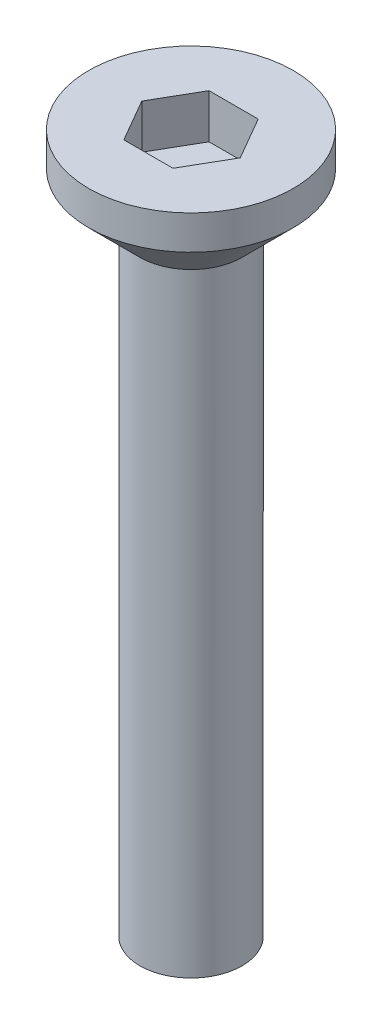
ISO-10303-21;
HEADER;
FILE_DESCRIPTION(('STEP AP214'),'2;1');
FILE_NAME('part.step','',(''),(''),'','','');
FILE_SCHEMA(('AUTOMOTIVE_DESIGN { 1 0 10303 214 1 1 1 1 }'));
ENDSEC;
DATA;
#1=APPLICATION_CONTEXT('core data for automotive mechanical design processes');
#2=APPLICATION_PROTOCOL_DEFINITION('international standard','automotive_design',2000,#1);
#3=PRODUCT_CONTEXT('',#1,'mechanical');
#4=PRODUCT('Part','Part','',(#3));
#5=PRODUCT_RELATED_PRODUCT_CATEGORY('part','',(#4));
#6=PRODUCT_DEFINITION_FORMATION('','',#4);
#7=PRODUCT_DEFINITION_CONTEXT('part definition',#1,'design');
#8=PRODUCT_DEFINITION('design','',#6,#7);
#9=PRODUCT_DEFINITION_SHAPE('','',#8);
#10=(LENGTH_UNIT() NAMED_UNIT(*) SI_UNIT(.MILLI.,.METRE.));
#11=(NAMED_UNIT(*) PLANE_ANGLE_UNIT() SI_UNIT($,.RADIAN.));
#12=(NAMED_UNIT(*) SI_UNIT($,.STERADIAN.) SOLID_ANGLE_UNIT());
#13=UNCERTAINTY_MEASURE_WITH_UNIT(LENGTH_MEASURE(1.E-05),#10,'distance_accuracy_value','');
#14=(GEOMETRIC_REPRESENTATION_CONTEXT(3) GLOBAL_UNCERTAINTY_ASSIGNED_CONTEXT((#13)) GLOBAL_UNIT_ASSIGNED_CONTEXT((#10,
#11,#12)) REPRESENTATION_CONTEXT('',''));
#15=CARTESIAN_POINT('',(0.,0.,0.));
#16=DIRECTION('',(0.,0.,1.));
#17=DIRECTION('',(1.,0.,0.));
#18=AXIS2_PLACEMENT_3D('',#15,#16,#17);
#19=CARTESIAN_POINT('',(0.,2.5,0.));
#20=DIRECTION('',(0.,-1.,0.));
#21=DIRECTION('',(0.,0.,-1.));
#22=AXIS2_PLACEMENT_3D('',#19,#20,#21);
#23=CYLINDRICAL_SURFACE('',#22,3.);
#24=CARTESIAN_POINT('',(0.,1.5,0.));
#25=DIRECTION('',(0.,1.,0.));
#26=DIRECTION('',(0.,0.,1.));
#27=AXIS2_PLACEMENT_3D('',#24,#25,#26);
#28=CIRCLE('',#27,3.);
#29=CARTESIAN_POINT('',(0.,1.5,3.));
#30=VERTEX_POINT('',#29);
#31=EDGE_CURVE('E45',#30,#30,#28,.T.);
#32=ORIENTED_EDGE('',*,*,#31,.T.);
#33=EDGE_LOOP('',(#32));
#34=FACE_BOUND('',#33,.T.);
#35=CARTESIAN_POINT('',(0.,2.5,0.));
#36=DIRECTION('',(0.,1.,0.));
#37=DIRECTION('',(0.,0.,1.));
#38=AXIS2_PLACEMENT_3D('',#35,#36,#37);
#39=CIRCLE('',#38,3.);
#40=CARTESIAN_POINT('',(0.,2.5,3.));
#41=VERTEX_POINT('',#40);
#42=EDGE_CURVE('E140',#41,#41,#39,.T.);
#43=ORIENTED_EDGE('',*,*,#42,.F.);
#44=EDGE_LOOP('',(#43));
#45=FACE_BOUND('',#44,.T.);
#46=ADVANCED_FACE('F37',(#34,#45),#23,.T.);
#47=CARTESIAN_POINT('',(0.,2.5,0.));
#48=DIRECTION('',(0.,1.,0.));
#49=DIRECTION('',(0.,0.,1.));
#50=AXIS2_PLACEMENT_3D('',#47,#48,#49);
#51=PLANE('',#50);
#52=DIRECTION('',(0.5,0.,-0.866025403784439));
#53=VECTOR('',#52,1.);
#54=CARTESIAN_POINT('',(0.721687836487032,2.5,1.25));
#55=LINE('',#54,#53);
#56=CARTESIAN_POINT('',(0.721687836487032,2.5,1.25));
#57=VERTEX_POINT('',#56);
#58=CARTESIAN_POINT('',(1.44337567297406,2.5,0.));
#59=VERTEX_POINT('',#58);
#60=EDGE_CURVE('E52',#57,#59,#55,.T.);
#61=ORIENTED_EDGE('',*,*,#60,.F.);
#62=DIRECTION('',(1.,0.,0.));
#63=VECTOR('',#62,1.);
#64=CARTESIAN_POINT('',(-0.721687836487033,2.5,1.25));
#65=LINE('',#64,#63);
#66=CARTESIAN_POINT('',(-0.721687836487033,2.5,1.25));
#67=VERTEX_POINT('',#66);
#68=EDGE_CURVE('E136',#67,#57,#65,.T.);
#69=ORIENTED_EDGE('',*,*,#68,.F.);
#70=DIRECTION('',(0.5,0.,0.866025403784439));
#71=VECTOR('',#70,1.);
#72=CARTESIAN_POINT('',(-1.44337567297407,2.5,0.));
#73=LINE('',#72,#71);
#74=CARTESIAN_POINT('',(-1.44337567297407,2.5,0.));
#75=VERTEX_POINT('',#74);
#76=EDGE_CURVE('E134',#75,#67,#73,.T.);
#77=ORIENTED_EDGE('',*,*,#76,.F.);
#78=DIRECTION('',(-0.5,0.,0.866025403784438));
#79=VECTOR('',#78,1.);
#80=CARTESIAN_POINT('',(-0.721687836487033,2.5,-1.25));
#81=LINE('',#80,#79);
#82=CARTESIAN_POINT('',(-0.721687836487033,2.5,-1.25));
#83=VERTEX_POINT('',#82);
#84=EDGE_CURVE('E100',#83,#75,#81,.T.);
#85=ORIENTED_EDGE('',*,*,#84,.F.);
#86=DIRECTION('',(-1.,0.,0.));
#87=VECTOR('',#86,1.);
#88=CARTESIAN_POINT('',(0.721687836487032,2.5,-1.25));
#89=LINE('',#88,#87);
#90=CARTESIAN_POINT('',(0.721687836487032,2.5,-1.25));
#91=VERTEX_POINT('',#90);
#92=EDGE_CURVE('E130',#91,#83,#89,.T.);
#93=ORIENTED_EDGE('',*,*,#92,.F.);
#94=DIRECTION('',(-0.5,0.,-0.866025403784439));
#95=VECTOR('',#94,1.);
#96=CARTESIAN_POINT('',(1.44337567297406,2.5,0.));
#97=LINE('',#96,#95);
#98=EDGE_CURVE('E126',#59,#91,#97,.T.);
#99=ORIENTED_EDGE('',*,*,#98,.F.);
#100=EDGE_LOOP('',(#61,#69,#77,#85,#93,#99));
#101=FACE_BOUND('',#100,.T.);
#102=ORIENTED_EDGE('',*,*,#42,.T.);
#103=EDGE_LOOP('',(#102));
#104=FACE_BOUND('',#103,.T.);
#105=ADVANCED_FACE('F154',(#101,#104),#51,.T.);
#106=CARTESIAN_POINT('',(0.,1.5,0.));
#107=DIRECTION('',(0.,1.,0.));
#108=DIRECTION('',(0.,0.,1.));
#109=AXIS2_PLACEMENT_3D('',#106,#107,#108);
#110=CONICAL_SURFACE('',#109,3.,0.78539816339745);
#111=CARTESIAN_POINT('',(0.,0.,0.));
#112=DIRECTION('',(0.,1.,0.));
#113=DIRECTION('',(0.,0.,1.));
#114=AXIS2_PLACEMENT_3D('',#111,#112,#113);
#115=CIRCLE('',#114,1.49999999999999);
#116=CARTESIAN_POINT('',(0.,0.,1.49999999999999));
#117=VERTEX_POINT('',#116);
#118=EDGE_CURVE('E11',#117,#117,#115,.F.);
#119=ORIENTED_EDGE('',*,*,#118,.F.);
#120=EDGE_LOOP('',(#119));
#121=FACE_BOUND('',#120,.T.);
#122=ORIENTED_EDGE('',*,*,#31,.F.);
#123=EDGE_LOOP('',(#122));
#124=FACE_BOUND('',#123,.T.);
#125=ADVANCED_FACE('F39',(#121,#124),#110,.T.);
#126=CARTESIAN_POINT('',(0.721687836487032,1.2,1.25));
#127=DIRECTION('',(0.866025403784439,0.,0.5));
#128=DIRECTION('',(0.5,0.,-0.866025403784439));
#129=AXIS2_PLACEMENT_3D('',#126,#127,#128);
#130=PLANE('',#129);
#131=ORIENTED_EDGE('',*,*,#60,.T.);
#132=DIRECTION('',(0.,1.,0.));
#133=VECTOR('',#132,1.);
#134=CARTESIAN_POINT('',(1.44337567297406,1.2,0.));
#135=LINE('',#134,#133);
#136=CARTESIAN_POINT('',(1.44337567297406,1.2,0.));
#137=VERTEX_POINT('',#136);
#138=EDGE_CURVE('E82',#137,#59,#135,.T.);
#139=ORIENTED_EDGE('',*,*,#138,.F.);
#140=DIRECTION('',(0.5,0.,-0.866025403784439));
#141=VECTOR('',#140,1.);
#142=CARTESIAN_POINT('',(0.721687836487032,1.2,1.25));
#143=LINE('',#142,#141);
#144=CARTESIAN_POINT('',(0.721687836487032,1.2,1.25));
#145=VERTEX_POINT('',#144);
#146=EDGE_CURVE('E138',#145,#137,#143,.T.);
#147=ORIENTED_EDGE('',*,*,#146,.F.);
#148=DIRECTION('',(0.,1.,0.));
#149=VECTOR('',#148,1.);
#150=CARTESIAN_POINT('',(0.721687836487032,1.2,1.25));
#151=LINE('',#150,#149);
#152=EDGE_CURVE('E60',#145,#57,#151,.T.);
#153=ORIENTED_EDGE('',*,*,#152,.T.);
#154=EDGE_LOOP('',(#131,#139,#147,#153));
#155=FACE_BOUND('',#154,.T.);
#156=ADVANCED_FACE('F153',(#155),#130,.F.);
#157=CARTESIAN_POINT('',(-0.721687836487033,1.2,1.25));
#158=DIRECTION('',(0.,0.,1.));
#159=DIRECTION('',(1.,0.,0.));
#160=AXIS2_PLACEMENT_3D('',#157,#158,#159);
#161=PLANE('',#160);
#162=ORIENTED_EDGE('',*,*,#68,.T.);
#163=ORIENTED_EDGE('',*,*,#152,.F.);
#164=DIRECTION('',(1.,0.,0.));
#165=VECTOR('',#164,1.);
#166=CARTESIAN_POINT('',(-0.721687836487033,1.2,1.25));
#167=LINE('',#166,#165);
#168=CARTESIAN_POINT('',(-0.721687836487033,1.2,1.25));
#169=VERTEX_POINT('',#168);
#170=EDGE_CURVE('E112',#169,#145,#167,.T.);
#171=ORIENTED_EDGE('',*,*,#170,.F.);
#172=DIRECTION('',(0.,1.,0.));
#173=VECTOR('',#172,1.);
#174=CARTESIAN_POINT('',(-0.721687836487033,1.2,1.25));
#175=LINE('',#174,#173);
#176=EDGE_CURVE('E104',#169,#67,#175,.T.);
#177=ORIENTED_EDGE('',*,*,#176,.T.);
#178=EDGE_LOOP('',(#162,#163,#171,#177));
#179=FACE_BOUND('',#178,.T.);
#180=ADVANCED_FACE('F160',(#179),#161,.F.);
#181=CARTESIAN_POINT('',(-1.44337567297407,1.2,0.));
#182=DIRECTION('',(-0.866025403784439,0.,0.5));
#183=DIRECTION('',(0.5,0.,0.866025403784439));
#184=AXIS2_PLACEMENT_3D('',#181,#182,#183);
#185=PLANE('',#184);
#186=ORIENTED_EDGE('',*,*,#76,.T.);
#187=ORIENTED_EDGE('',*,*,#176,.F.);
#188=DIRECTION('',(0.5,0.,0.866025403784439));
#189=VECTOR('',#188,1.);
#190=CARTESIAN_POINT('',(-1.44337567297407,1.2,0.));
#191=LINE('',#190,#189);
#192=CARTESIAN_POINT('',(-1.44337567297407,1.2,0.));
#193=VERTEX_POINT('',#192);
#194=EDGE_CURVE('E108',#193,#169,#191,.T.);
#195=ORIENTED_EDGE('',*,*,#194,.F.);
#196=DIRECTION('',(0.,1.,0.));
#197=VECTOR('',#196,1.);
#198=CARTESIAN_POINT('',(-1.44337567297407,1.2,0.));
#199=LINE('',#198,#197);
#200=EDGE_CURVE('E93',#193,#75,#199,.T.);
#201=ORIENTED_EDGE('',*,*,#200,.T.);
#202=EDGE_LOOP('',(#186,#187,#195,#201));
#203=FACE_BOUND('',#202,.T.);
#204=ADVANCED_FACE('F109',(#203),#185,.F.);
#205=CARTESIAN_POINT('',(-0.721687836487033,1.2,-1.25));
#206=DIRECTION('',(-0.866025403784439,0.,-0.5));
#207=DIRECTION('',(-0.5,0.,0.866025403784439));
#208=AXIS2_PLACEMENT_3D('',#205,#206,#207);
#209=PLANE('',#208);
#210=ORIENTED_EDGE('',*,*,#84,.T.);
#211=ORIENTED_EDGE('',*,*,#200,.F.);
#212=DIRECTION('',(-0.5,0.,0.866025403784438));
#213=VECTOR('',#212,1.);
#214=CARTESIAN_POINT('',(-0.721687836487033,1.2,-1.25));
#215=LINE('',#214,#213);
#216=CARTESIAN_POINT('',(-0.721687836487033,1.2,-1.25));
#217=VERTEX_POINT('',#216);
#218=EDGE_CURVE('E97',#217,#193,#215,.T.);
#219=ORIENTED_EDGE('',*,*,#218,.F.);
#220=DIRECTION('',(0.,1.,0.));
#221=VECTOR('',#220,1.);
#222=CARTESIAN_POINT('',(-0.721687836487033,1.2,-1.25));
#223=LINE('',#222,#221);
#224=EDGE_CURVE('E105',#217,#83,#223,.T.);
#225=ORIENTED_EDGE('',*,*,#224,.T.);
#226=EDGE_LOOP('',(#210,#211,#219,#225));
#227=FACE_BOUND('',#226,.T.);
#228=ADVANCED_FACE('F95',(#227),#209,.F.);
#229=CARTESIAN_POINT('',(0.721687836487032,1.2,-1.25));
#230=DIRECTION('',(0.,0.,-1.));
#231=DIRECTION('',(-1.,0.,0.));
#232=AXIS2_PLACEMENT_3D('',#229,#230,#231);
#233=PLANE('',#232);
#234=ORIENTED_EDGE('',*,*,#92,.T.);
#235=ORIENTED_EDGE('',*,*,#224,.F.);
#236=DIRECTION('',(-1.,0.,0.));
#237=VECTOR('',#236,1.);
#238=CARTESIAN_POINT('',(0.721687836487032,1.2,-1.25));
#239=LINE('',#238,#237);
#240=CARTESIAN_POINT('',(0.721687836487032,1.2,-1.25));
#241=VERTEX_POINT('',#240);
#242=EDGE_CURVE('E118',#241,#217,#239,.T.);
#243=ORIENTED_EDGE('',*,*,#242,.F.);
#244=DIRECTION('',(0.,1.,0.));
#245=VECTOR('',#244,1.);
#246=CARTESIAN_POINT('',(0.721687836487032,1.2,-1.25));
#247=LINE('',#246,#245);
#248=EDGE_CURVE('E143',#241,#91,#247,.T.);
#249=ORIENTED_EDGE('',*,*,#248,.T.);
#250=EDGE_LOOP('',(#234,#235,#243,#249));
#251=FACE_BOUND('',#250,.T.);
#252=ADVANCED_FACE('F172',(#251),#233,.F.);
#253=CARTESIAN_POINT('',(1.44337567297406,1.2,0.));
#254=DIRECTION('',(0.866025403784439,0.,-0.5));
#255=DIRECTION('',(-0.5,0.,-0.866025403784439));
#256=AXIS2_PLACEMENT_3D('',#253,#254,#255);
#257=PLANE('',#256);
#258=ORIENTED_EDGE('',*,*,#98,.T.);
#259=ORIENTED_EDGE('',*,*,#248,.F.);
#260=DIRECTION('',(-0.5,0.,-0.866025403784439));
#261=VECTOR('',#260,1.);
#262=CARTESIAN_POINT('',(1.44337567297406,1.2,0.));
#263=LINE('',#262,#261);
#264=EDGE_CURVE('E120',#137,#241,#263,.T.);
#265=ORIENTED_EDGE('',*,*,#264,.F.);
#266=ORIENTED_EDGE('',*,*,#138,.T.);
#267=EDGE_LOOP('',(#258,#259,#265,#266));
#268=FACE_BOUND('',#267,.T.);
#269=ADVANCED_FACE('F169',(#268),#257,.F.);
#270=CARTESIAN_POINT('',(0.,1.2,0.));
#271=DIRECTION('',(0.,1.,0.));
#272=DIRECTION('',(0.,0.,1.));
#273=AXIS2_PLACEMENT_3D('',#270,#271,#272);
#274=PLANE('',#273);
#275=ORIENTED_EDGE('',*,*,#146,.T.);
#276=ORIENTED_EDGE('',*,*,#264,.T.);
#277=ORIENTED_EDGE('',*,*,#242,.T.);
#278=ORIENTED_EDGE('',*,*,#218,.T.);
#279=ORIENTED_EDGE('',*,*,#194,.T.);
#280=ORIENTED_EDGE('',*,*,#170,.T.);
#281=EDGE_LOOP('',(#275,#276,#277,#278,#279,#280));
#282=FACE_BOUND('',#281,.T.);
#283=ADVANCED_FACE('F115',(#282),#274,.T.);
#284=CARTESIAN_POINT('',(0.,-18.,0.));
#285=DIRECTION('',(0.,1.,0.));
#286=DIRECTION('',(0.,0.,1.));
#287=AXIS2_PLACEMENT_3D('',#284,#285,#286);
#288=CYLINDRICAL_SURFACE('',#287,1.5);
#289=CARTESIAN_POINT('',(0.,-18.,0.));
#290=DIRECTION('',(0.,-1.,0.));
#291=DIRECTION('',(0.,0.,-1.));
#292=AXIS2_PLACEMENT_3D('',#289,#290,#291);
#293=CIRCLE('',#292,1.5);
#294=CARTESIAN_POINT('',(0.,-18.,-1.5));
#295=VERTEX_POINT('',#294);
#296=EDGE_CURVE('E127',#295,#295,#293,.T.);
#297=ORIENTED_EDGE('',*,*,#296,.F.);
#298=EDGE_LOOP('',(#297));
#299=FACE_BOUND('',#298,.T.);
#300=ORIENTED_EDGE('',*,*,#118,.T.);
#301=EDGE_LOOP('',(#300));
#302=FACE_BOUND('',#301,.T.);
#303=ADVANCED_FACE('F185',(#299,#302),#288,.T.);
#304=CARTESIAN_POINT('',(0.,-18.,0.));
#305=DIRECTION('',(0.,-1.,0.));
#306=DIRECTION('',(0.,0.,-1.));
#307=AXIS2_PLACEMENT_3D('',#304,#305,#306);
#308=PLANE('',#307);
#309=ORIENTED_EDGE('',*,*,#296,.T.);
#310=EDGE_LOOP('',(#309));
#311=FACE_BOUND('',#310,.T.);
#312=ADVANCED_FACE('F188',(#311),#308,.T.);
#313=CLOSED_SHELL('',(#46,#105,#125,#156,#180,#204,#228,#252,#269,#283,#303,#312));
#314=MANIFOLD_SOLID_BREP('B2',#313);
#315=ADVANCED_BREP_SHAPE_REPRESENTATION('',(#18,#314),#14);
#316=SHAPE_DEFINITION_REPRESENTATION(#9,#315);
ENDSEC;
END-ISO-10303-21;
